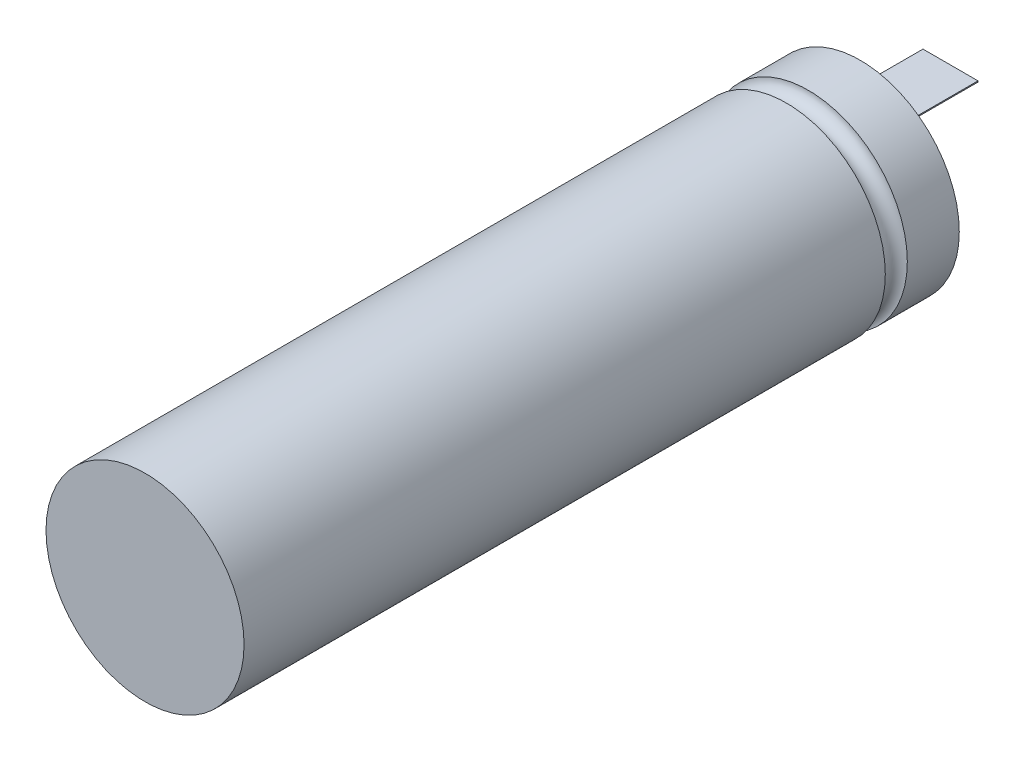
ISO-10303-21;
HEADER;
FILE_DESCRIPTION(('STEP AP214'),'2;1');
FILE_NAME('part.step','',(''),(''),'','','');
FILE_SCHEMA(('AUTOMOTIVE_DESIGN { 1 0 10303 214 1 1 1 1 }'));
ENDSEC;
DATA;
#1=APPLICATION_CONTEXT('core data for automotive mechanical design processes');
#2=APPLICATION_PROTOCOL_DEFINITION('international standard','automotive_design',2000,#1);
#3=PRODUCT_CONTEXT('',#1,'mechanical');
#4=PRODUCT('Part','Part','',(#3));
#5=PRODUCT_RELATED_PRODUCT_CATEGORY('part','',(#4));
#6=PRODUCT_DEFINITION_FORMATION('','',#4);
#7=PRODUCT_DEFINITION_CONTEXT('part definition',#1,'design');
#8=PRODUCT_DEFINITION('design','',#6,#7);
#9=PRODUCT_DEFINITION_SHAPE('','',#8);
#10=(LENGTH_UNIT() NAMED_UNIT(*) SI_UNIT(.MILLI.,.METRE.));
#11=(NAMED_UNIT(*) PLANE_ANGLE_UNIT() SI_UNIT($,.RADIAN.));
#12=(NAMED_UNIT(*) SI_UNIT($,.STERADIAN.) SOLID_ANGLE_UNIT());
#13=UNCERTAINTY_MEASURE_WITH_UNIT(LENGTH_MEASURE(1.E-05),#10,'distance_accuracy_value','');
#14=(GEOMETRIC_REPRESENTATION_CONTEXT(3) GLOBAL_UNCERTAINTY_ASSIGNED_CONTEXT((#13)) GLOBAL_UNIT_ASSIGNED_CONTEXT((#10,
#11,#12)) REPRESENTATION_CONTEXT('',''));
#15=CARTESIAN_POINT('',(0.,0.,0.));
#16=DIRECTION('',(0.,0.,1.));
#17=DIRECTION('',(1.,0.,0.));
#18=AXIS2_PLACEMENT_3D('',#15,#16,#17);
#19=CARTESIAN_POINT('',(0.,0.,32.3));
#20=DIRECTION('',(0.,0.,1.));
#21=DIRECTION('',(1.,0.,0.));
#22=AXIS2_PLACEMENT_3D('',#19,#20,#21);
#23=PLANE('',#22);
#24=CARTESIAN_POINT('',(0.,0.,32.3));
#25=DIRECTION('',(0.,0.,1.));
#26=DIRECTION('',(1.,0.,0.));
#27=AXIS2_PLACEMENT_3D('',#24,#25,#26);
#28=CIRCLE('',#27,8.8);
#29=CARTESIAN_POINT('',(8.8,0.,32.3));
#30=VERTEX_POINT('',#29);
#31=EDGE_CURVE('E107',#30,#30,#28,.T.);
#32=ORIENTED_EDGE('',*,*,#31,.F.);
#33=EDGE_LOOP('',(#32));
#34=FACE_BOUND('',#33,.T.);
#35=DIRECTION('',(0.,1.,0.));
#36=VECTOR('',#35,1.);
#37=CARTESIAN_POINT('',(-2.5,4.52378588171536,32.3));
#38=LINE('',#37,#36);
#39=CARTESIAN_POINT('',(-2.5,4.42378588171536,32.3));
#40=VERTEX_POINT('',#39);
#41=CARTESIAN_POINT('',(-2.5,4.52378588171536,32.3));
#42=VERTEX_POINT('',#41);
#43=EDGE_CURVE('E97',#40,#42,#38,.T.);
#44=ORIENTED_EDGE('',*,*,#43,.F.);
#45=DIRECTION('',(-1.,0.,0.));
#46=VECTOR('',#45,1.);
#47=CARTESIAN_POINT('',(2.5,4.42378588171536,32.3));
#48=LINE('',#47,#46);
#49=CARTESIAN_POINT('',(2.5,4.42378588171536,32.3));
#50=VERTEX_POINT('',#49);
#51=EDGE_CURVE('E94',#50,#40,#48,.T.);
#52=ORIENTED_EDGE('',*,*,#51,.F.);
#53=DIRECTION('',(0.,-1.,0.));
#54=VECTOR('',#53,1.);
#55=CARTESIAN_POINT('',(2.5,4.52378588171536,32.3));
#56=LINE('',#55,#54);
#57=CARTESIAN_POINT('',(2.5,4.52378588171536,32.3));
#58=VERTEX_POINT('',#57);
#59=EDGE_CURVE('E56',#58,#50,#56,.T.);
#60=ORIENTED_EDGE('',*,*,#59,.F.);
#61=DIRECTION('',(1.,0.,0.));
#62=VECTOR('',#61,1.);
#63=CARTESIAN_POINT('',(2.5,4.52378588171536,32.3));
#64=LINE('',#63,#62);
#65=EDGE_CURVE('E51',#42,#58,#64,.T.);
#66=ORIENTED_EDGE('',*,*,#65,.F.);
#67=EDGE_LOOP('',(#44,#52,#60,#66));
#68=FACE_BOUND('',#67,.T.);
#69=ADVANCED_FACE('F34',(#34,#68),#23,.F.);
#70=CARTESIAN_POINT('',(0.,0.,32.5));
#71=DIRECTION('',(0.,0.,-1.));
#72=DIRECTION('',(-1.,0.,0.));
#73=AXIS2_PLACEMENT_3D('',#70,#71,#72);
#74=CYLINDRICAL_SURFACE('',#73,9.);
#75=CARTESIAN_POINT('',(0.,0.,32.5));
#76=DIRECTION('',(0.,0.,1.));
#77=DIRECTION('',(1.,0.,0.));
#78=AXIS2_PLACEMENT_3D('',#75,#76,#77);
#79=CIRCLE('',#78,9.);
#80=CARTESIAN_POINT('',(9.,0.,32.5));
#81=VERTEX_POINT('',#80);
#82=EDGE_CURVE('E11',#81,#81,#79,.T.);
#83=ORIENTED_EDGE('',*,*,#82,.F.);
#84=EDGE_LOOP('',(#83));
#85=FACE_BOUND('',#84,.T.);
#86=CARTESIAN_POINT('',(0.,0.,-25.7769712675489));
#87=DIRECTION('',(0.,0.,-1.));
#88=DIRECTION('',(-1.,0.,0.));
#89=AXIS2_PLACEMENT_3D('',#86,#87,#88);
#90=CIRCLE('',#89,9.);
#91=CARTESIAN_POINT('',(-9.,0.,-25.7769712675489));
#92=VERTEX_POINT('',#91);
#93=EDGE_CURVE('E38',#92,#92,#90,.T.);
#94=ORIENTED_EDGE('',*,*,#93,.F.);
#95=EDGE_LOOP('',(#94));
#96=FACE_BOUND('',#95,.T.);
#97=ADVANCED_FACE('F36',(#85,#96),#74,.T.);
#98=CARTESIAN_POINT('',(0.,0.,32.5));
#99=DIRECTION('',(0.,0.,1.));
#100=DIRECTION('',(1.,0.,0.));
#101=AXIS2_PLACEMENT_3D('',#98,#99,#100);
#102=PLANE('',#101);
#103=ORIENTED_EDGE('',*,*,#82,.T.);
#104=EDGE_LOOP('',(#103));
#105=FACE_BOUND('',#104,.T.);
#106=ADVANCED_FACE('F126',(#105),#102,.T.);
#107=CARTESIAN_POINT('',(0.,0.,-26.7769712675489));
#108=DIRECTION('',(0.,0.,1.));
#109=DIRECTION('',(1.,0.,0.));
#110=AXIS2_PLACEMENT_3D('',#107,#108,#109);
#111=TOROIDAL_SURFACE('',#110,9.,1.);
#112=CARTESIAN_POINT('',(0.,0.,-27.7769712675489));
#113=DIRECTION('',(0.,0.,1.));
#114=DIRECTION('',(1.,0.,0.));
#115=AXIS2_PLACEMENT_3D('',#112,#113,#114);
#116=CIRCLE('',#115,9.);
#117=CARTESIAN_POINT('',(9.,0.,-27.7769712675489));
#118=VERTEX_POINT('',#117);
#119=EDGE_CURVE('E110',#118,#118,#116,.T.);
#120=ORIENTED_EDGE('',*,*,#119,.T.);
#121=EDGE_LOOP('',(#120));
#122=FACE_BOUND('',#121,.T.);
#123=ORIENTED_EDGE('',*,*,#93,.T.);
#124=EDGE_LOOP('',(#123));
#125=FACE_BOUND('',#124,.T.);
#126=ADVANCED_FACE('F123',(#122,#125),#111,.F.);
#127=CARTESIAN_POINT('',(0.,0.,-32.5));
#128=DIRECTION('',(0.,0.,1.));
#129=DIRECTION('',(1.,0.,0.));
#130=AXIS2_PLACEMENT_3D('',#127,#128,#129);
#131=PLANE('',#130);
#132=CARTESIAN_POINT('',(0.,0.,-32.5));
#133=DIRECTION('',(0.,0.,1.));
#134=DIRECTION('',(1.,0.,0.));
#135=AXIS2_PLACEMENT_3D('',#132,#133,#134);
#136=CIRCLE('',#135,8.8);
#137=CARTESIAN_POINT('',(8.8,0.,-32.5));
#138=VERTEX_POINT('',#137);
#139=EDGE_CURVE('E111',#138,#138,#136,.T.);
#140=ORIENTED_EDGE('',*,*,#139,.T.);
#141=EDGE_LOOP('',(#140));
#142=FACE_BOUND('',#141,.T.);
#143=CARTESIAN_POINT('',(0.,0.,-32.5));
#144=DIRECTION('',(0.,0.,1.));
#145=DIRECTION('',(1.,0.,0.));
#146=AXIS2_PLACEMENT_3D('',#143,#144,#145);
#147=CIRCLE('',#146,9.);
#148=CARTESIAN_POINT('',(9.,0.,-32.5));
#149=VERTEX_POINT('',#148);
#150=EDGE_CURVE('E43',#149,#149,#147,.T.);
#151=ORIENTED_EDGE('',*,*,#150,.F.);
#152=EDGE_LOOP('',(#151));
#153=FACE_BOUND('',#152,.T.);
#154=ADVANCED_FACE('F140',(#142,#153),#131,.F.);
#155=ORIENTED_EDGE('',*,*,#150,.T.);
#156=EDGE_LOOP('',(#155));
#157=FACE_BOUND('',#156,.T.);
#158=ORIENTED_EDGE('',*,*,#119,.F.);
#159=EDGE_LOOP('',(#158));
#160=FACE_BOUND('',#159,.T.);
#161=ADVANCED_FACE('F128',(#157,#160),#74,.T.);
#162=CARTESIAN_POINT('',(0.,0.,32.5));
#163=DIRECTION('',(0.,0.,-1.));
#164=DIRECTION('',(-1.,0.,0.));
#165=AXIS2_PLACEMENT_3D('',#162,#163,#164);
#166=CYLINDRICAL_SURFACE('',#165,8.8);
#167=ORIENTED_EDGE('',*,*,#31,.T.);
#168=EDGE_LOOP('',(#167));
#169=FACE_BOUND('',#168,.T.);
#170=CARTESIAN_POINT('',(0.,0.,-25.593755310929));
#171=DIRECTION('',(0.,0.,-1.));
#172=DIRECTION('',(-1.,0.,0.));
#173=AXIS2_PLACEMENT_3D('',#170,#171,#172);
#174=CIRCLE('',#173,8.8);
#175=CARTESIAN_POINT('',(-8.8,0.,-25.593755310929));
#176=VERTEX_POINT('',#175);
#177=EDGE_CURVE('E101',#176,#176,#174,.T.);
#178=ORIENTED_EDGE('',*,*,#177,.T.);
#179=EDGE_LOOP('',(#178));
#180=FACE_BOUND('',#179,.T.);
#181=ADVANCED_FACE('F139',(#169,#180),#166,.F.);
#182=CARTESIAN_POINT('',(0.,0.,-26.7769712675489));
#183=DIRECTION('',(0.,0.,1.));
#184=DIRECTION('',(1.,0.,0.));
#185=AXIS2_PLACEMENT_3D('',#182,#183,#184);
#186=TOROIDAL_SURFACE('',#185,9.,1.2);
#187=CARTESIAN_POINT('',(0.,0.,-27.9601872241689));
#188=DIRECTION('',(0.,0.,1.));
#189=DIRECTION('',(1.,0.,0.));
#190=AXIS2_PLACEMENT_3D('',#187,#188,#189);
#191=CIRCLE('',#190,8.8);
#192=CARTESIAN_POINT('',(8.8,0.,-27.9601872241689));
#193=VERTEX_POINT('',#192);
#194=EDGE_CURVE('E98',#193,#193,#191,.T.);
#195=ORIENTED_EDGE('',*,*,#194,.F.);
#196=EDGE_LOOP('',(#195));
#197=FACE_BOUND('',#196,.T.);
#198=ORIENTED_EDGE('',*,*,#177,.F.);
#199=EDGE_LOOP('',(#198));
#200=FACE_BOUND('',#199,.T.);
#201=ADVANCED_FACE('F146',(#197,#200),#186,.T.);
#202=ORIENTED_EDGE('',*,*,#139,.F.);
#203=EDGE_LOOP('',(#202));
#204=FACE_BOUND('',#203,.T.);
#205=ORIENTED_EDGE('',*,*,#194,.T.);
#206=EDGE_LOOP('',(#205));
#207=FACE_BOUND('',#206,.T.);
#208=ADVANCED_FACE('F149',(#204,#207),#166,.F.);
#209=CARTESIAN_POINT('',(-2.5,4.52378588171536,-40.7));
#210=DIRECTION('',(1.,0.,0.));
#211=DIRECTION('',(0.,0.,-1.));
#212=AXIS2_PLACEMENT_3D('',#209,#210,#211);
#213=PLANE('',#212);
#214=ORIENTED_EDGE('',*,*,#43,.T.);
#215=DIRECTION('',(0.,0.,1.));
#216=VECTOR('',#215,1.);
#217=CARTESIAN_POINT('',(-2.5,4.52378588171536,-40.7));
#218=LINE('',#217,#216);
#219=CARTESIAN_POINT('',(-2.5,4.52378588171536,-40.7));
#220=VERTEX_POINT('',#219);
#221=EDGE_CURVE('E78',#220,#42,#218,.T.);
#222=ORIENTED_EDGE('',*,*,#221,.F.);
#223=DIRECTION('',(0.,1.,0.));
#224=VECTOR('',#223,1.);
#225=CARTESIAN_POINT('',(-2.5,4.52378588171536,-40.7));
#226=LINE('',#225,#224);
#227=CARTESIAN_POINT('',(-2.5,4.42378588171536,-40.7));
#228=VERTEX_POINT('',#227);
#229=EDGE_CURVE('E85',#228,#220,#226,.T.);
#230=ORIENTED_EDGE('',*,*,#229,.F.);
#231=DIRECTION('',(0.,0.,1.));
#232=VECTOR('',#231,1.);
#233=CARTESIAN_POINT('',(-2.5,4.42378588171536,-40.7));
#234=LINE('',#233,#232);
#235=EDGE_CURVE('E263',#228,#40,#234,.T.);
#236=ORIENTED_EDGE('',*,*,#235,.T.);
#237=EDGE_LOOP('',(#214,#222,#230,#236));
#238=FACE_BOUND('',#237,.T.);
#239=ADVANCED_FACE('F96',(#238),#213,.F.);
#240=CARTESIAN_POINT('',(2.5,4.52378588171536,-40.7));
#241=DIRECTION('',(0.,-1.,0.));
#242=DIRECTION('',(0.,0.,-1.));
#243=AXIS2_PLACEMENT_3D('',#240,#241,#242);
#244=PLANE('',#243);
#245=ORIENTED_EDGE('',*,*,#65,.T.);
#246=DIRECTION('',(0.,0.,1.));
#247=VECTOR('',#246,1.);
#248=CARTESIAN_POINT('',(2.5,4.52378588171536,-40.7));
#249=LINE('',#248,#247);
#250=CARTESIAN_POINT('',(2.5,4.52378588171536,-40.7));
#251=VERTEX_POINT('',#250);
#252=EDGE_CURVE('E81',#251,#58,#249,.T.);
#253=ORIENTED_EDGE('',*,*,#252,.F.);
#254=DIRECTION('',(1.,0.,0.));
#255=VECTOR('',#254,1.);
#256=CARTESIAN_POINT('',(2.5,4.52378588171536,-40.7));
#257=LINE('',#256,#255);
#258=EDGE_CURVE('E74',#220,#251,#257,.T.);
#259=ORIENTED_EDGE('',*,*,#258,.F.);
#260=ORIENTED_EDGE('',*,*,#221,.T.);
#261=EDGE_LOOP('',(#245,#253,#259,#260));
#262=FACE_BOUND('',#261,.T.);
#263=ADVANCED_FACE('F76',(#262),#244,.F.);
#264=CARTESIAN_POINT('',(2.5,4.52378588171536,-40.7));
#265=DIRECTION('',(-1.,0.,0.));
#266=DIRECTION('',(0.,0.,1.));
#267=AXIS2_PLACEMENT_3D('',#264,#265,#266);
#268=PLANE('',#267);
#269=ORIENTED_EDGE('',*,*,#59,.T.);
#270=DIRECTION('',(0.,0.,1.));
#271=VECTOR('',#270,1.);
#272=CARTESIAN_POINT('',(2.5,4.42378588171536,-40.7));
#273=LINE('',#272,#271);
#274=CARTESIAN_POINT('',(2.5,4.42378588171536,-40.7));
#275=VERTEX_POINT('',#274);
#276=EDGE_CURVE('E103',#275,#50,#273,.T.);
#277=ORIENTED_EDGE('',*,*,#276,.F.);
#278=DIRECTION('',(0.,-1.,0.));
#279=VECTOR('',#278,1.);
#280=CARTESIAN_POINT('',(2.5,4.52378588171536,-40.7));
#281=LINE('',#280,#279);
#282=EDGE_CURVE('E84',#251,#275,#281,.T.);
#283=ORIENTED_EDGE('',*,*,#282,.F.);
#284=ORIENTED_EDGE('',*,*,#252,.T.);
#285=EDGE_LOOP('',(#269,#277,#283,#284));
#286=FACE_BOUND('',#285,.T.);
#287=ADVANCED_FACE('F166',(#286),#268,.F.);
#288=CARTESIAN_POINT('',(2.5,4.42378588171536,-40.7));
#289=DIRECTION('',(0.,1.,0.));
#290=DIRECTION('',(0.,0.,1.));
#291=AXIS2_PLACEMENT_3D('',#288,#289,#290);
#292=PLANE('',#291);
#293=ORIENTED_EDGE('',*,*,#51,.T.);
#294=ORIENTED_EDGE('',*,*,#235,.F.);
#295=DIRECTION('',(-1.,0.,0.));
#296=VECTOR('',#295,1.);
#297=CARTESIAN_POINT('',(2.5,4.42378588171536,-40.7));
#298=LINE('',#297,#296);
#299=EDGE_CURVE('E90',#275,#228,#298,.T.);
#300=ORIENTED_EDGE('',*,*,#299,.F.);
#301=ORIENTED_EDGE('',*,*,#276,.T.);
#302=EDGE_LOOP('',(#293,#294,#300,#301));
#303=FACE_BOUND('',#302,.T.);
#304=ADVANCED_FACE('F169',(#303),#292,.F.);
#305=CARTESIAN_POINT('',(0.,0.,-40.7));
#306=DIRECTION('',(0.,0.,-1.));
#307=DIRECTION('',(-1.,0.,0.));
#308=AXIS2_PLACEMENT_3D('',#305,#306,#307);
#309=PLANE('',#308);
#310=ORIENTED_EDGE('',*,*,#229,.T.);
#311=ORIENTED_EDGE('',*,*,#258,.T.);
#312=ORIENTED_EDGE('',*,*,#282,.T.);
#313=ORIENTED_EDGE('',*,*,#299,.T.);
#314=EDGE_LOOP('',(#310,#311,#312,#313));
#315=FACE_BOUND('',#314,.T.);
#316=ADVANCED_FACE('F88',(#315),#309,.T.);
#317=CLOSED_SHELL('',(#69,#97,#106,#126,#154,#161,#181,#201,#208,#239,#263,#287,#304,#316));
#318=MANIFOLD_SOLID_BREP('B2',#317);
#319=ADVANCED_BREP_SHAPE_REPRESENTATION('',(#18,#318),#14);
#320=SHAPE_DEFINITION_REPRESENTATION(#9,#319);
ENDSEC;
END-ISO-10303-21;
